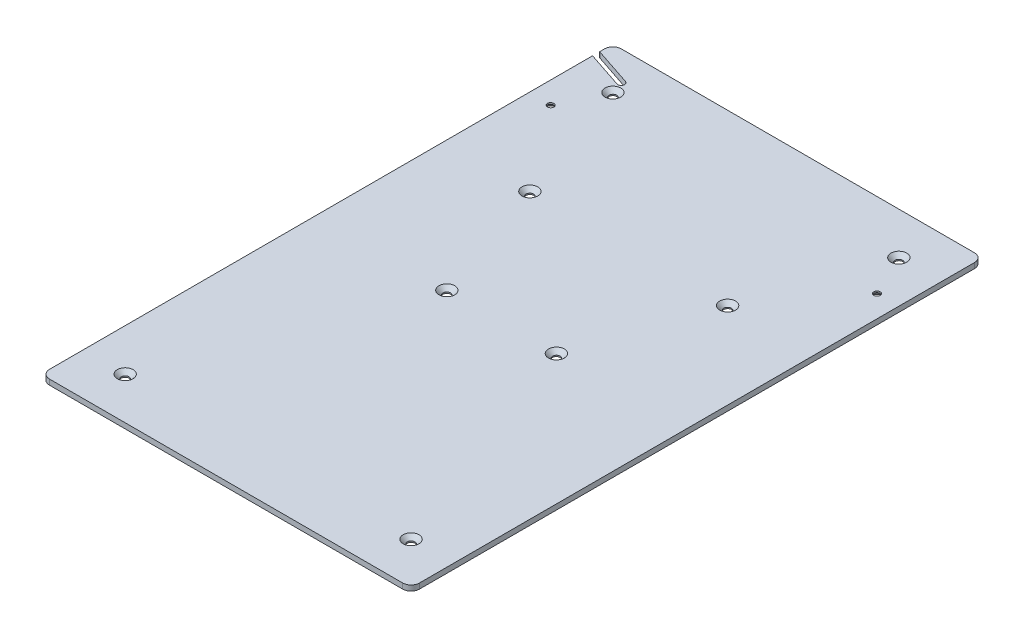
ISO-10303-21;
HEADER;
FILE_DESCRIPTION(('STEP AP214'),'2;1');
FILE_NAME('part.step','',(''),(''),'','','');
FILE_SCHEMA(('AUTOMOTIVE_DESIGN { 1 0 10303 214 1 1 1 1 }'));
ENDSEC;
DATA;
#1=APPLICATION_CONTEXT('core data for automotive mechanical design processes');
#2=APPLICATION_PROTOCOL_DEFINITION('international standard','automotive_design',2000,#1);
#3=PRODUCT_CONTEXT('',#1,'mechanical');
#4=PRODUCT('Part','Part','',(#3));
#5=PRODUCT_RELATED_PRODUCT_CATEGORY('part','',(#4));
#6=PRODUCT_DEFINITION_FORMATION('','',#4);
#7=PRODUCT_DEFINITION_CONTEXT('part definition',#1,'design');
#8=PRODUCT_DEFINITION('design','',#6,#7);
#9=PRODUCT_DEFINITION_SHAPE('','',#8);
#10=(LENGTH_UNIT() NAMED_UNIT(*) SI_UNIT(.MILLI.,.METRE.));
#11=(NAMED_UNIT(*) PLANE_ANGLE_UNIT() SI_UNIT($,.RADIAN.));
#12=(NAMED_UNIT(*) SI_UNIT($,.STERADIAN.) SOLID_ANGLE_UNIT());
#13=UNCERTAINTY_MEASURE_WITH_UNIT(LENGTH_MEASURE(1.E-05),#10,'distance_accuracy_value','');
#14=(GEOMETRIC_REPRESENTATION_CONTEXT(3) GLOBAL_UNCERTAINTY_ASSIGNED_CONTEXT((#13)) GLOBAL_UNIT_ASSIGNED_CONTEXT((#10,
#11,#12)) REPRESENTATION_CONTEXT('',''));
#15=CARTESIAN_POINT('',(0.,0.,0.));
#16=DIRECTION('',(0.,0.,1.));
#17=DIRECTION('',(1.,0.,0.));
#18=AXIS2_PLACEMENT_3D('',#15,#16,#17);
#19=CARTESIAN_POINT('',(-110.,3.175,-170.));
#20=DIRECTION('',(1.,0.,0.));
#21=DIRECTION('',(0.,0.,-1.));
#22=AXIS2_PLACEMENT_3D('',#19,#20,#21);
#23=PLANE('',#22);
#24=DIRECTION('',(0.,0.,1.));
#25=VECTOR('',#24,1.);
#26=CARTESIAN_POINT('',(-110.,0.,-170.));
#27=LINE('',#26,#25);
#28=CARTESIAN_POINT('',(-110.,0.,-165.));
#29=VERTEX_POINT('',#28);
#30=CARTESIAN_POINT('',(-110.,0.,-162.));
#31=VERTEX_POINT('',#30);
#32=EDGE_CURVE('E278',#29,#31,#27,.T.);
#33=ORIENTED_EDGE('',*,*,#32,.T.);
#34=DIRECTION('',(0.,1.,0.));
#35=VECTOR('',#34,1.);
#36=CARTESIAN_POINT('',(-110.,0.,-162.));
#37=LINE('',#36,#35);
#38=CARTESIAN_POINT('',(-110.,3.175,-162.));
#39=VERTEX_POINT('',#38);
#40=EDGE_CURVE('E171',#31,#39,#37,.T.);
#41=ORIENTED_EDGE('',*,*,#40,.T.);
#42=DIRECTION('',(0.,0.,1.));
#43=VECTOR('',#42,1.);
#44=CARTESIAN_POINT('',(-110.,3.175,-170.));
#45=LINE('',#44,#43);
#46=CARTESIAN_POINT('',(-110.,3.175,-165.));
#47=VERTEX_POINT('',#46);
#48=EDGE_CURVE('E265',#47,#39,#45,.T.);
#49=ORIENTED_EDGE('',*,*,#48,.F.);
#50=DIRECTION('',(0.,-1.,0.));
#51=VECTOR('',#50,1.);
#52=CARTESIAN_POINT('',(-110.,3.175,-165.));
#53=LINE('',#52,#51);
#54=EDGE_CURVE('E318',#47,#29,#53,.T.);
#55=ORIENTED_EDGE('',*,*,#54,.T.);
#56=EDGE_LOOP('',(#33,#41,#49,#55));
#57=FACE_BOUND('',#56,.T.);
#58=ADVANCED_FACE('F39',(#57),#23,.F.);
#59=CARTESIAN_POINT('',(-110.,3.175,-157.892304050488));
#60=VERTEX_POINT('',#59);
#61=CARTESIAN_POINT('',(-110.,3.175,165.));
#62=VERTEX_POINT('',#61);
#63=EDGE_CURVE('E269',#60,#62,#45,.T.);
#64=ORIENTED_EDGE('',*,*,#63,.F.);
#65=DIRECTION('',(0.,-1.,0.));
#66=VECTOR('',#65,1.);
#67=CARTESIAN_POINT('',(-110.,3.175,-157.892304050488));
#68=LINE('',#67,#66);
#69=CARTESIAN_POINT('',(-110.,0.,-157.892304050488));
#70=VERTEX_POINT('',#69);
#71=EDGE_CURVE('E166',#60,#70,#68,.T.);
#72=ORIENTED_EDGE('',*,*,#71,.T.);
#73=CARTESIAN_POINT('',(-110.,0.,165.));
#74=VERTEX_POINT('',#73);
#75=EDGE_CURVE('E264',#70,#74,#27,.T.);
#76=ORIENTED_EDGE('',*,*,#75,.T.);
#77=DIRECTION('',(0.,-1.,0.));
#78=VECTOR('',#77,1.);
#79=CARTESIAN_POINT('',(-110.,3.175,165.));
#80=LINE('',#79,#78);
#81=EDGE_CURVE('E315',#74,#62,#80,.F.);
#82=ORIENTED_EDGE('',*,*,#81,.T.);
#83=EDGE_LOOP('',(#64,#72,#76,#82));
#84=FACE_BOUND('',#83,.T.);
#85=ADVANCED_FACE('F373',(#84),#23,.F.);
#86=CARTESIAN_POINT('',(-110.,3.175,170.));
#87=DIRECTION('',(0.,0.,-1.));
#88=DIRECTION('',(-1.,0.,0.));
#89=AXIS2_PLACEMENT_3D('',#86,#87,#88);
#90=PLANE('',#89);
#91=DIRECTION('',(1.,0.,0.));
#92=VECTOR('',#91,1.);
#93=CARTESIAN_POINT('',(-110.,3.175,170.));
#94=LINE('',#93,#92);
#95=CARTESIAN_POINT('',(-105.,3.175,170.));
#96=VERTEX_POINT('',#95);
#97=CARTESIAN_POINT('',(105.,3.175,170.));
#98=VERTEX_POINT('',#97);
#99=EDGE_CURVE('E268',#96,#98,#94,.T.);
#100=ORIENTED_EDGE('',*,*,#99,.F.);
#101=DIRECTION('',(0.,-1.,0.));
#102=VECTOR('',#101,1.);
#103=CARTESIAN_POINT('',(-105.,3.175,170.));
#104=LINE('',#103,#102);
#105=CARTESIAN_POINT('',(-105.,0.,170.));
#106=VERTEX_POINT('',#105);
#107=EDGE_CURVE('E47',#96,#106,#104,.T.);
#108=ORIENTED_EDGE('',*,*,#107,.T.);
#109=DIRECTION('',(1.,0.,0.));
#110=VECTOR('',#109,1.);
#111=CARTESIAN_POINT('',(-110.,0.,170.));
#112=LINE('',#111,#110);
#113=CARTESIAN_POINT('',(105.,0.,170.));
#114=VERTEX_POINT('',#113);
#115=EDGE_CURVE('E281',#106,#114,#112,.T.);
#116=ORIENTED_EDGE('',*,*,#115,.T.);
#117=DIRECTION('',(0.,-1.,0.));
#118=VECTOR('',#117,1.);
#119=CARTESIAN_POINT('',(105.,3.175,170.));
#120=LINE('',#119,#118);
#121=EDGE_CURVE('E62',#114,#98,#120,.F.);
#122=ORIENTED_EDGE('',*,*,#121,.T.);
#123=EDGE_LOOP('',(#100,#108,#116,#122));
#124=FACE_BOUND('',#123,.T.);
#125=ADVANCED_FACE('F324',(#124),#90,.F.);
#126=CARTESIAN_POINT('',(110.,3.175,-170.));
#127=DIRECTION('',(-1.,0.,0.));
#128=DIRECTION('',(0.,0.,1.));
#129=AXIS2_PLACEMENT_3D('',#126,#127,#128);
#130=PLANE('',#129);
#131=DIRECTION('',(0.,0.,-1.));
#132=VECTOR('',#131,1.);
#133=CARTESIAN_POINT('',(110.,0.,-170.));
#134=LINE('',#133,#132);
#135=CARTESIAN_POINT('',(110.,0.,165.));
#136=VERTEX_POINT('',#135);
#137=CARTESIAN_POINT('',(110.,0.,-165.));
#138=VERTEX_POINT('',#137);
#139=EDGE_CURVE('E283',#136,#138,#134,.T.);
#140=ORIENTED_EDGE('',*,*,#139,.T.);
#141=DIRECTION('',(0.,-1.,0.));
#142=VECTOR('',#141,1.);
#143=CARTESIAN_POINT('',(110.,3.175,-165.));
#144=LINE('',#143,#142);
#145=CARTESIAN_POINT('',(110.,3.175,-165.));
#146=VERTEX_POINT('',#145);
#147=EDGE_CURVE('E305',#138,#146,#144,.F.);
#148=ORIENTED_EDGE('',*,*,#147,.T.);
#149=DIRECTION('',(0.,0.,-1.));
#150=VECTOR('',#149,1.);
#151=CARTESIAN_POINT('',(110.,3.175,-170.));
#152=LINE('',#151,#150);
#153=CARTESIAN_POINT('',(110.,3.175,165.));
#154=VERTEX_POINT('',#153);
#155=EDGE_CURVE('E271',#154,#146,#152,.T.);
#156=ORIENTED_EDGE('',*,*,#155,.F.);
#157=DIRECTION('',(0.,-1.,0.));
#158=VECTOR('',#157,1.);
#159=CARTESIAN_POINT('',(110.,3.175,165.));
#160=LINE('',#159,#158);
#161=EDGE_CURVE('E302',#154,#136,#160,.T.);
#162=ORIENTED_EDGE('',*,*,#161,.T.);
#163=EDGE_LOOP('',(#140,#148,#156,#162));
#164=FACE_BOUND('',#163,.T.);
#165=ADVANCED_FACE('F334',(#164),#130,.F.);
#166=CARTESIAN_POINT('',(-110.,3.175,-170.));
#167=DIRECTION('',(0.,0.,1.));
#168=DIRECTION('',(1.,0.,0.));
#169=AXIS2_PLACEMENT_3D('',#166,#167,#168);
#170=PLANE('',#169);
#171=DIRECTION('',(-1.,0.,0.));
#172=VECTOR('',#171,1.);
#173=CARTESIAN_POINT('',(-110.,3.175,-170.));
#174=LINE('',#173,#172);
#175=CARTESIAN_POINT('',(105.,3.175,-170.));
#176=VERTEX_POINT('',#175);
#177=CARTESIAN_POINT('',(-105.,3.175,-170.));
#178=VERTEX_POINT('',#177);
#179=EDGE_CURVE('E274',#176,#178,#174,.T.);
#180=ORIENTED_EDGE('',*,*,#179,.F.);
#181=DIRECTION('',(0.,-1.,0.));
#182=VECTOR('',#181,1.);
#183=CARTESIAN_POINT('',(105.,3.175,-170.));
#184=LINE('',#183,#182);
#185=CARTESIAN_POINT('',(105.,0.,-170.));
#186=VERTEX_POINT('',#185);
#187=EDGE_CURVE('E290',#176,#186,#184,.T.);
#188=ORIENTED_EDGE('',*,*,#187,.T.);
#189=DIRECTION('',(-1.,0.,0.));
#190=VECTOR('',#189,1.);
#191=CARTESIAN_POINT('',(-110.,0.,-170.));
#192=LINE('',#191,#190);
#193=CARTESIAN_POINT('',(-105.,0.,-170.));
#194=VERTEX_POINT('',#193);
#195=EDGE_CURVE('E286',#186,#194,#192,.T.);
#196=ORIENTED_EDGE('',*,*,#195,.T.);
#197=DIRECTION('',(0.,-1.,0.));
#198=VECTOR('',#197,1.);
#199=CARTESIAN_POINT('',(-105.,3.175,-170.));
#200=LINE('',#199,#198);
#201=EDGE_CURVE('E277',#194,#178,#200,.F.);
#202=ORIENTED_EDGE('',*,*,#201,.T.);
#203=EDGE_LOOP('',(#180,#188,#196,#202));
#204=FACE_BOUND('',#203,.T.);
#205=ADVANCED_FACE('F347',(#204),#170,.F.);
#206=CARTESIAN_POINT('',(-110.,3.175,170.));
#207=DIRECTION('',(0.,1.,0.));
#208=DIRECTION('',(0.,0.,1.));
#209=AXIS2_PLACEMENT_3D('',#206,#207,#208);
#210=PLANE('',#209);
#211=CARTESIAN_POINT('',(-110.,3.175,-160.));
#212=DIRECTION('',(0.,1.,0.));
#213=DIRECTION('',(0.,0.,1.));
#214=AXIS2_PLACEMENT_3D('',#211,#212,#213);
#215=CIRCLE('',#214,1.99999999999997);
#216=CARTESIAN_POINT('',(-109.368867035246,3.175,-161.897806939813));
#217=VERTEX_POINT('',#216);
#218=EDGE_CURVE('E160',#217,#39,#215,.T.);
#219=ORIENTED_EDGE('',*,*,#218,.F.);
#220=DIRECTION('',(-0.948903469906339,0.,-0.315566482376866));
#221=VECTOR('',#220,1.);
#222=CARTESIAN_POINT('',(-109.368867035246,3.175,-161.897806939813));
#223=LINE('',#222,#221);
#224=CARTESIAN_POINT('',(-86.9910486519973,3.175,-154.455859835154));
#225=VERTEX_POINT('',#224);
#226=EDGE_CURVE('E157',#225,#217,#223,.T.);
#227=ORIENTED_EDGE('',*,*,#226,.F.);
#228=CARTESIAN_POINT('',(-87.622181616751,3.175,-152.558052895341));
#229=DIRECTION('',(0.,1.,0.));
#230=DIRECTION('',(0.,0.,1.));
#231=AXIS2_PLACEMENT_3D('',#228,#229,#230);
#232=CIRCLE('',#231,2.00000000000001);
#233=CARTESIAN_POINT('',(-88.2533145815047,3.175,-150.660245955528));
#234=VERTEX_POINT('',#233);
#235=EDGE_CURVE('E139',#234,#225,#232,.T.);
#236=ORIENTED_EDGE('',*,*,#235,.F.);
#237=DIRECTION('',(0.948903469906338,0.,0.31556648237687));
#238=VECTOR('',#237,1.);
#239=CARTESIAN_POINT('',(-110.631132964754,3.175,-158.102193060187));
#240=LINE('',#239,#238);
#241=EDGE_CURVE('E162',#60,#234,#240,.T.);
#242=ORIENTED_EDGE('',*,*,#241,.F.);
#243=ORIENTED_EDGE('',*,*,#63,.T.);
#244=CARTESIAN_POINT('',(-105.,3.175,165.));
#245=DIRECTION('',(0.,1.,0.));
#246=DIRECTION('',(0.,0.,1.));
#247=AXIS2_PLACEMENT_3D('',#244,#245,#246);
#248=CIRCLE('',#247,5.);
#249=EDGE_CURVE('E309',#62,#96,#248,.T.);
#250=ORIENTED_EDGE('',*,*,#249,.T.);
#251=ORIENTED_EDGE('',*,*,#99,.T.);
#252=CARTESIAN_POINT('',(105.,3.175,165.));
#253=DIRECTION('',(0.,1.,0.));
#254=DIRECTION('',(0.,0.,1.));
#255=AXIS2_PLACEMENT_3D('',#252,#253,#254);
#256=CIRCLE('',#255,5.);
#257=EDGE_CURVE('E307',#98,#154,#256,.T.);
#258=ORIENTED_EDGE('',*,*,#257,.T.);
#259=ORIENTED_EDGE('',*,*,#155,.T.);
#260=CARTESIAN_POINT('',(105.,3.175,-165.));
#261=DIRECTION('',(0.,1.,0.));
#262=DIRECTION('',(0.,0.,1.));
#263=AXIS2_PLACEMENT_3D('',#260,#261,#262);
#264=CIRCLE('',#263,5.);
#265=EDGE_CURVE('E313',#146,#176,#264,.T.);
#266=ORIENTED_EDGE('',*,*,#265,.T.);
#267=ORIENTED_EDGE('',*,*,#179,.T.);
#268=CARTESIAN_POINT('',(-105.,3.175,-165.));
#269=DIRECTION('',(0.,1.,0.));
#270=DIRECTION('',(0.,0.,1.));
#271=AXIS2_PLACEMENT_3D('',#268,#269,#270);
#272=CIRCLE('',#271,5.);
#273=EDGE_CURVE('E311',#178,#47,#272,.T.);
#274=ORIENTED_EDGE('',*,*,#273,.T.);
#275=ORIENTED_EDGE('',*,*,#48,.T.);
#276=EDGE_LOOP('',(#219,#227,#236,#242,#243,#250,#251,#258,#259,#266,#267,#274,#275));
#277=FACE_BOUND('',#276,.T.);
#278=CARTESIAN_POINT('',(85.,3.175,145.));
#279=DIRECTION('',(0.,1.,0.));
#280=DIRECTION('',(0.,0.,1.));
#281=AXIS2_PLACEMENT_3D('',#278,#279,#280);
#282=CIRCLE('',#281,4.7);
#283=CARTESIAN_POINT('',(85.,3.175,149.7));
#284=VERTEX_POINT('',#283);
#285=EDGE_CURVE('E174',#284,#284,#282,.T.);
#286=ORIENTED_EDGE('',*,*,#285,.F.);
#287=EDGE_LOOP('',(#286));
#288=FACE_BOUND('',#287,.T.);
#289=CARTESIAN_POINT('',(32.5563676649805,3.175,6.16105790682097));
#290=DIRECTION('',(0.,1.,0.));
#291=DIRECTION('',(0.,0.,1.));
#292=AXIS2_PLACEMENT_3D('',#289,#290,#291);
#293=CIRCLE('',#292,4.7);
#294=CARTESIAN_POINT('',(32.5563676649805,3.175,10.861057906821));
#295=VERTEX_POINT('',#294);
#296=EDGE_CURVE('E183',#295,#295,#293,.T.);
#297=ORIENTED_EDGE('',*,*,#296,.F.);
#298=EDGE_LOOP('',(#297));
#299=FACE_BOUND('',#298,.T.);
#300=CARTESIAN_POINT('',(58.7781838324903,3.175,-69.4194710465895));
#301=DIRECTION('',(0.,1.,0.));
#302=DIRECTION('',(0.,0.,1.));
#303=AXIS2_PLACEMENT_3D('',#300,#301,#302);
#304=CIRCLE('',#303,4.7);
#305=CARTESIAN_POINT('',(58.7781838324903,3.175,-64.7194710465895));
#306=VERTEX_POINT('',#305);
#307=EDGE_CURVE('E192',#306,#306,#304,.T.);
#308=ORIENTED_EDGE('',*,*,#307,.F.);
#309=EDGE_LOOP('',(#308));
#310=FACE_BOUND('',#309,.T.);
#311=CARTESIAN_POINT('',(85.,3.175,-145.));
#312=DIRECTION('',(0.,1.,0.));
#313=DIRECTION('',(0.,0.,1.));
#314=AXIS2_PLACEMENT_3D('',#311,#312,#313);
#315=CIRCLE('',#314,4.7);
#316=CARTESIAN_POINT('',(85.,3.175,-140.3));
#317=VERTEX_POINT('',#316);
#318=EDGE_CURVE('E201',#317,#317,#315,.T.);
#319=ORIENTED_EDGE('',*,*,#318,.F.);
#320=EDGE_LOOP('',(#319));
#321=FACE_BOUND('',#320,.T.);
#322=CARTESIAN_POINT('',(-85.,3.175,145.));
#323=DIRECTION('',(0.,1.,0.));
#324=DIRECTION('',(0.,0.,1.));
#325=AXIS2_PLACEMENT_3D('',#322,#323,#324);
#326=CIRCLE('',#325,4.7);
#327=CARTESIAN_POINT('',(-85.,3.175,149.7));
#328=VERTEX_POINT('',#327);
#329=EDGE_CURVE('E210',#328,#328,#326,.T.);
#330=ORIENTED_EDGE('',*,*,#329,.F.);
#331=EDGE_LOOP('',(#330));
#332=FACE_BOUND('',#331,.T.);
#333=CARTESIAN_POINT('',(-32.5563676649805,3.175,6.16105790682097));
#334=DIRECTION('',(0.,1.,0.));
#335=DIRECTION('',(0.,0.,1.));
#336=AXIS2_PLACEMENT_3D('',#333,#334,#335);
#337=CIRCLE('',#336,4.7);
#338=CARTESIAN_POINT('',(-32.5563676649805,3.175,10.861057906821));
#339=VERTEX_POINT('',#338);
#340=EDGE_CURVE('E219',#339,#339,#337,.T.);
#341=ORIENTED_EDGE('',*,*,#340,.F.);
#342=EDGE_LOOP('',(#341));
#343=FACE_BOUND('',#342,.T.);
#344=CARTESIAN_POINT('',(-58.7781838324903,3.175,-69.4194710465895));
#345=DIRECTION('',(0.,1.,0.));
#346=DIRECTION('',(0.,0.,1.));
#347=AXIS2_PLACEMENT_3D('',#344,#345,#346);
#348=CIRCLE('',#347,4.7);
#349=CARTESIAN_POINT('',(-58.7781838324903,3.175,-64.7194710465895));
#350=VERTEX_POINT('',#349);
#351=EDGE_CURVE('E228',#350,#350,#348,.T.);
#352=ORIENTED_EDGE('',*,*,#351,.F.);
#353=EDGE_LOOP('',(#352));
#354=FACE_BOUND('',#353,.T.);
#355=CARTESIAN_POINT('',(-85.,3.175,-145.));
#356=DIRECTION('',(0.,1.,0.));
#357=DIRECTION('',(0.,0.,1.));
#358=AXIS2_PLACEMENT_3D('',#355,#356,#357);
#359=CIRCLE('',#358,4.7);
#360=CARTESIAN_POINT('',(-85.,3.175,-140.3));
#361=VERTEX_POINT('',#360);
#362=EDGE_CURVE('E237',#361,#361,#359,.T.);
#363=ORIENTED_EDGE('',*,*,#362,.F.);
#364=EDGE_LOOP('',(#363));
#365=FACE_BOUND('',#364,.T.);
#366=CARTESIAN_POINT('',(97.,3.175,-120.));
#367=DIRECTION('',(0.,-1.,0.));
#368=DIRECTION('',(0.,0.,-1.));
#369=AXIS2_PLACEMENT_3D('',#366,#367,#368);
#370=CIRCLE('',#369,1.89865);
#371=CARTESIAN_POINT('',(97.,3.175,-121.89865));
#372=VERTEX_POINT('',#371);
#373=EDGE_CURVE('E252',#372,#372,#370,.T.);
#374=ORIENTED_EDGE('',*,*,#373,.T.);
#375=EDGE_LOOP('',(#374));
#376=FACE_BOUND('',#375,.T.);
#377=CARTESIAN_POINT('',(-97.,3.175,-120.));
#378=DIRECTION('',(0.,-1.,0.));
#379=DIRECTION('',(0.,0.,-1.));
#380=AXIS2_PLACEMENT_3D('',#377,#378,#379);
#381=CIRCLE('',#380,1.89865);
#382=CARTESIAN_POINT('',(-97.,3.175,-121.89865));
#383=VERTEX_POINT('',#382);
#384=EDGE_CURVE('E261',#383,#383,#381,.T.);
#385=ORIENTED_EDGE('',*,*,#384,.T.);
#386=EDGE_LOOP('',(#385));
#387=FACE_BOUND('',#386,.T.);
#388=ADVANCED_FACE('F339',(#277,#288,#299,#310,#321,#332,#343,#354,#365,#376,#387),#210,.T.);
#389=CARTESIAN_POINT('',(-110.,0.,170.));
#390=DIRECTION('',(0.,1.,0.));
#391=DIRECTION('',(0.,0.,1.));
#392=AXIS2_PLACEMENT_3D('',#389,#390,#391);
#393=PLANE('',#392);
#394=CARTESIAN_POINT('',(85.,1.83447007584547E-13,145.));
#395=DIRECTION('',(0.,1.,0.));
#396=DIRECTION('',(0.,0.,1.));
#397=AXIS2_PLACEMENT_3D('',#394,#395,#396);
#398=CIRCLE('',#397,2.25);
#399=CARTESIAN_POINT('',(85.,1.83447007584547E-13,147.25));
#400=VERTEX_POINT('',#399);
#401=EDGE_CURVE('E180',#400,#400,#398,.T.);
#402=ORIENTED_EDGE('',*,*,#401,.T.);
#403=EDGE_LOOP('',(#402));
#404=FACE_BOUND('',#403,.T.);
#405=CARTESIAN_POINT('',(32.5563676649805,1.83447007584547E-13,6.16105790682097));
#406=DIRECTION('',(0.,1.,0.));
#407=DIRECTION('',(0.,0.,1.));
#408=AXIS2_PLACEMENT_3D('',#405,#406,#407);
#409=CIRCLE('',#408,2.25);
#410=CARTESIAN_POINT('',(32.5563676649805,1.83447007584547E-13,8.41105790682097));
#411=VERTEX_POINT('',#410);
#412=EDGE_CURVE('E189',#411,#411,#409,.T.);
#413=ORIENTED_EDGE('',*,*,#412,.T.);
#414=EDGE_LOOP('',(#413));
#415=FACE_BOUND('',#414,.T.);
#416=CARTESIAN_POINT('',(58.7781838324903,1.83447007584547E-13,-69.4194710465895));
#417=DIRECTION('',(0.,1.,0.));
#418=DIRECTION('',(0.,0.,1.));
#419=AXIS2_PLACEMENT_3D('',#416,#417,#418);
#420=CIRCLE('',#419,2.25);
#421=CARTESIAN_POINT('',(58.7781838324903,1.83447007584547E-13,-67.1694710465895));
#422=VERTEX_POINT('',#421);
#423=EDGE_CURVE('E198',#422,#422,#420,.T.);
#424=ORIENTED_EDGE('',*,*,#423,.T.);
#425=EDGE_LOOP('',(#424));
#426=FACE_BOUND('',#425,.T.);
#427=CARTESIAN_POINT('',(85.,1.83447007584547E-13,-145.));
#428=DIRECTION('',(0.,1.,0.));
#429=DIRECTION('',(0.,0.,1.));
#430=AXIS2_PLACEMENT_3D('',#427,#428,#429);
#431=CIRCLE('',#430,2.25);
#432=CARTESIAN_POINT('',(85.,1.83447007584547E-13,-142.75));
#433=VERTEX_POINT('',#432);
#434=EDGE_CURVE('E207',#433,#433,#431,.T.);
#435=ORIENTED_EDGE('',*,*,#434,.T.);
#436=EDGE_LOOP('',(#435));
#437=FACE_BOUND('',#436,.T.);
#438=CARTESIAN_POINT('',(-85.,1.83447007584547E-13,145.));
#439=DIRECTION('',(0.,1.,0.));
#440=DIRECTION('',(0.,0.,1.));
#441=AXIS2_PLACEMENT_3D('',#438,#439,#440);
#442=CIRCLE('',#441,2.25);
#443=CARTESIAN_POINT('',(-85.,1.83447007584547E-13,147.25));
#444=VERTEX_POINT('',#443);
#445=EDGE_CURVE('E216',#444,#444,#442,.T.);
#446=ORIENTED_EDGE('',*,*,#445,.T.);
#447=EDGE_LOOP('',(#446));
#448=FACE_BOUND('',#447,.T.);
#449=CARTESIAN_POINT('',(-32.5563676649805,1.83447007584547E-13,6.16105790682097));
#450=DIRECTION('',(0.,1.,0.));
#451=DIRECTION('',(0.,0.,1.));
#452=AXIS2_PLACEMENT_3D('',#449,#450,#451);
#453=CIRCLE('',#452,2.25);
#454=CARTESIAN_POINT('',(-32.5563676649805,1.83447007584547E-13,8.41105790682097));
#455=VERTEX_POINT('',#454);
#456=EDGE_CURVE('E225',#455,#455,#453,.T.);
#457=ORIENTED_EDGE('',*,*,#456,.T.);
#458=EDGE_LOOP('',(#457));
#459=FACE_BOUND('',#458,.T.);
#460=CARTESIAN_POINT('',(-58.7781838324903,1.83447007584547E-13,-69.4194710465895));
#461=DIRECTION('',(0.,1.,0.));
#462=DIRECTION('',(0.,0.,1.));
#463=AXIS2_PLACEMENT_3D('',#460,#461,#462);
#464=CIRCLE('',#463,2.25);
#465=CARTESIAN_POINT('',(-58.7781838324903,1.83447007584547E-13,-67.1694710465895));
#466=VERTEX_POINT('',#465);
#467=EDGE_CURVE('E234',#466,#466,#464,.T.);
#468=ORIENTED_EDGE('',*,*,#467,.T.);
#469=EDGE_LOOP('',(#468));
#470=FACE_BOUND('',#469,.T.);
#471=CARTESIAN_POINT('',(-85.,1.83447007584547E-13,-145.));
#472=DIRECTION('',(0.,1.,0.));
#473=DIRECTION('',(0.,0.,1.));
#474=AXIS2_PLACEMENT_3D('',#471,#472,#473);
#475=CIRCLE('',#474,2.25);
#476=CARTESIAN_POINT('',(-85.,1.83447007584547E-13,-142.75));
#477=VERTEX_POINT('',#476);
#478=EDGE_CURVE('E243',#477,#477,#475,.T.);
#479=ORIENTED_EDGE('',*,*,#478,.T.);
#480=EDGE_LOOP('',(#479));
#481=FACE_BOUND('',#480,.T.);
#482=CARTESIAN_POINT('',(97.,0.,-120.));
#483=DIRECTION('',(0.,-1.,0.));
#484=DIRECTION('',(0.,0.,-1.));
#485=AXIS2_PLACEMENT_3D('',#482,#483,#484);
#486=CIRCLE('',#485,3.8989);
#487=CARTESIAN_POINT('',(97.,0.,-123.8989));
#488=VERTEX_POINT('',#487);
#489=EDGE_CURVE('E246',#488,#488,#486,.T.);
#490=ORIENTED_EDGE('',*,*,#489,.F.);
#491=EDGE_LOOP('',(#490));
#492=FACE_BOUND('',#491,.T.);
#493=CARTESIAN_POINT('',(-97.,0.,-120.));
#494=DIRECTION('',(0.,-1.,0.));
#495=DIRECTION('',(0.,0.,-1.));
#496=AXIS2_PLACEMENT_3D('',#493,#494,#495);
#497=CIRCLE('',#496,3.8989);
#498=CARTESIAN_POINT('',(-97.,0.,-123.8989));
#499=VERTEX_POINT('',#498);
#500=EDGE_CURVE('E255',#499,#499,#497,.T.);
#501=ORIENTED_EDGE('',*,*,#500,.F.);
#502=EDGE_LOOP('',(#501));
#503=FACE_BOUND('',#502,.T.);
#504=DIRECTION('',(-0.948903469906339,0.,-0.315566482376866));
#505=VECTOR('',#504,1.);
#506=CARTESIAN_POINT('',(-109.368867035246,0.,-161.897806939813));
#507=LINE('',#506,#505);
#508=CARTESIAN_POINT('',(-86.9910486519973,0.,-154.455859835154));
#509=VERTEX_POINT('',#508);
#510=CARTESIAN_POINT('',(-109.368867035246,0.,-161.897806939813));
#511=VERTEX_POINT('',#510);
#512=EDGE_CURVE('E147',#509,#511,#507,.T.);
#513=ORIENTED_EDGE('',*,*,#512,.T.);
#514=CARTESIAN_POINT('',(-110.,0.,-160.));
#515=DIRECTION('',(0.,1.,0.));
#516=DIRECTION('',(0.,0.,1.));
#517=AXIS2_PLACEMENT_3D('',#514,#515,#516);
#518=CIRCLE('',#517,1.99999999999997);
#519=EDGE_CURVE('E155',#511,#31,#518,.T.);
#520=ORIENTED_EDGE('',*,*,#519,.T.);
#521=ORIENTED_EDGE('',*,*,#32,.F.);
#522=CARTESIAN_POINT('',(-105.,0.,-165.));
#523=DIRECTION('',(0.,1.,0.));
#524=DIRECTION('',(0.,0.,1.));
#525=AXIS2_PLACEMENT_3D('',#522,#523,#524);
#526=CIRCLE('',#525,5.);
#527=EDGE_CURVE('E298',#29,#194,#526,.F.);
#528=ORIENTED_EDGE('',*,*,#527,.T.);
#529=ORIENTED_EDGE('',*,*,#195,.F.);
#530=CARTESIAN_POINT('',(105.,0.,-165.));
#531=DIRECTION('',(0.,1.,0.));
#532=DIRECTION('',(0.,0.,1.));
#533=AXIS2_PLACEMENT_3D('',#530,#531,#532);
#534=CIRCLE('',#533,5.);
#535=EDGE_CURVE('E300',#186,#138,#534,.F.);
#536=ORIENTED_EDGE('',*,*,#535,.T.);
#537=ORIENTED_EDGE('',*,*,#139,.F.);
#538=CARTESIAN_POINT('',(105.,0.,165.));
#539=DIRECTION('',(0.,1.,0.));
#540=DIRECTION('',(0.,0.,1.));
#541=AXIS2_PLACEMENT_3D('',#538,#539,#540);
#542=CIRCLE('',#541,5.);
#543=EDGE_CURVE('E293',#136,#114,#542,.F.);
#544=ORIENTED_EDGE('',*,*,#543,.T.);
#545=ORIENTED_EDGE('',*,*,#115,.F.);
#546=CARTESIAN_POINT('',(-105.,0.,165.));
#547=DIRECTION('',(0.,1.,0.));
#548=DIRECTION('',(0.,0.,1.));
#549=AXIS2_PLACEMENT_3D('',#546,#547,#548);
#550=CIRCLE('',#549,5.);
#551=EDGE_CURVE('E295',#106,#74,#550,.F.);
#552=ORIENTED_EDGE('',*,*,#551,.T.);
#553=ORIENTED_EDGE('',*,*,#75,.F.);
#554=DIRECTION('',(0.948903469906338,0.,0.31556648237687));
#555=VECTOR('',#554,1.);
#556=CARTESIAN_POINT('',(-11.8152300272825,0.,-125.240065476283));
#557=LINE('',#556,#555);
#558=CARTESIAN_POINT('',(-88.2533145815047,0.,-150.660245955528));
#559=VERTEX_POINT('',#558);
#560=EDGE_CURVE('E11',#70,#559,#557,.T.);
#561=ORIENTED_EDGE('',*,*,#560,.T.);
#562=CARTESIAN_POINT('',(-87.622181616751,0.,-152.558052895341));
#563=DIRECTION('',(0.,1.,0.));
#564=DIRECTION('',(0.,0.,1.));
#565=AXIS2_PLACEMENT_3D('',#562,#563,#564);
#566=CIRCLE('',#565,2.00000000000001);
#567=EDGE_CURVE('E54',#559,#509,#566,.T.);
#568=ORIENTED_EDGE('',*,*,#567,.T.);
#569=EDGE_LOOP('',(#513,#520,#521,#528,#529,#536,#537,#544,#545,#552,#553,#561,#568));
#570=FACE_BOUND('',#569,.T.);
#571=ADVANCED_FACE('F153',(#404,#415,#426,#437,#448,#459,#470,#481,#492,#503,#570),#393,.F.);
#572=CARTESIAN_POINT('',(105.,3.175,-165.));
#573=DIRECTION('',(0.,-1.,0.));
#574=DIRECTION('',(0.,0.,-1.));
#575=AXIS2_PLACEMENT_3D('',#572,#573,#574);
#576=CYLINDRICAL_SURFACE('',#575,5.);
#577=ORIENTED_EDGE('',*,*,#265,.F.);
#578=ORIENTED_EDGE('',*,*,#147,.F.);
#579=ORIENTED_EDGE('',*,*,#535,.F.);
#580=ORIENTED_EDGE('',*,*,#187,.F.);
#581=EDGE_LOOP('',(#577,#578,#579,#580));
#582=FACE_BOUND('',#581,.T.);
#583=ADVANCED_FACE('F344',(#582),#576,.T.);
#584=CARTESIAN_POINT('',(-105.,3.175,-165.));
#585=DIRECTION('',(0.,-1.,0.));
#586=DIRECTION('',(0.,0.,-1.));
#587=AXIS2_PLACEMENT_3D('',#584,#585,#586);
#588=CYLINDRICAL_SURFACE('',#587,5.);
#589=ORIENTED_EDGE('',*,*,#273,.F.);
#590=ORIENTED_EDGE('',*,*,#201,.F.);
#591=ORIENTED_EDGE('',*,*,#527,.F.);
#592=ORIENTED_EDGE('',*,*,#54,.F.);
#593=EDGE_LOOP('',(#589,#590,#591,#592));
#594=FACE_BOUND('',#593,.T.);
#595=ADVANCED_FACE('F353',(#594),#588,.T.);
#596=CARTESIAN_POINT('',(-105.,3.175,165.));
#597=DIRECTION('',(0.,-1.,0.));
#598=DIRECTION('',(0.,0.,-1.));
#599=AXIS2_PLACEMENT_3D('',#596,#597,#598);
#600=CYLINDRICAL_SURFACE('',#599,5.);
#601=ORIENTED_EDGE('',*,*,#249,.F.);
#602=ORIENTED_EDGE('',*,*,#81,.F.);
#603=ORIENTED_EDGE('',*,*,#551,.F.);
#604=ORIENTED_EDGE('',*,*,#107,.F.);
#605=EDGE_LOOP('',(#601,#602,#603,#604));
#606=FACE_BOUND('',#605,.T.);
#607=ADVANCED_FACE('F386',(#606),#600,.T.);
#608=CARTESIAN_POINT('',(105.,3.175,165.));
#609=DIRECTION('',(0.,-1.,0.));
#610=DIRECTION('',(0.,0.,-1.));
#611=AXIS2_PLACEMENT_3D('',#608,#609,#610);
#612=CYLINDRICAL_SURFACE('',#611,5.);
#613=ORIENTED_EDGE('',*,*,#257,.F.);
#614=ORIENTED_EDGE('',*,*,#121,.F.);
#615=ORIENTED_EDGE('',*,*,#543,.F.);
#616=ORIENTED_EDGE('',*,*,#161,.F.);
#617=EDGE_LOOP('',(#613,#614,#615,#616));
#618=FACE_BOUND('',#617,.T.);
#619=ADVANCED_FACE('F41',(#618),#612,.T.);
#620=CARTESIAN_POINT('',(-97.,0.,-120.));
#621=DIRECTION('',(0.,-1.,0.));
#622=DIRECTION('',(0.,0.,-1.));
#623=AXIS2_PLACEMENT_3D('',#620,#621,#622);
#624=CYLINDRICAL_SURFACE('',#623,1.89865);
#625=ORIENTED_EDGE('',*,*,#384,.F.);
#626=EDGE_LOOP('',(#625));
#627=FACE_BOUND('',#626,.T.);
#628=CARTESIAN_POINT('',(-97.,2.30102440654382,-120.));
#629=DIRECTION('',(0.,-1.,0.));
#630=DIRECTION('',(0.,0.,-1.));
#631=AXIS2_PLACEMENT_3D('',#628,#629,#630);
#632=CIRCLE('',#631,1.89865);
#633=CARTESIAN_POINT('',(-97.,2.30102440654382,-121.89865));
#634=VERTEX_POINT('',#633);
#635=EDGE_CURVE('E258',#634,#634,#632,.T.);
#636=ORIENTED_EDGE('',*,*,#635,.T.);
#637=EDGE_LOOP('',(#636));
#638=FACE_BOUND('',#637,.T.);
#639=ADVANCED_FACE('F391',(#627,#638),#624,.F.);
#640=CARTESIAN_POINT('',(-97.,0.,-120.));
#641=DIRECTION('',(0.,-1.,0.));
#642=DIRECTION('',(0.,0.,-1.));
#643=AXIS2_PLACEMENT_3D('',#640,#641,#642);
#644=CONICAL_SURFACE('',#643,3.8989,0.715584993317675);
#645=ORIENTED_EDGE('',*,*,#635,.F.);
#646=EDGE_LOOP('',(#645));
#647=FACE_BOUND('',#646,.T.);
#648=ORIENTED_EDGE('',*,*,#500,.T.);
#649=EDGE_LOOP('',(#648));
#650=FACE_BOUND('',#649,.T.);
#651=ADVANCED_FACE('F397',(#647,#650),#644,.F.);
#652=CARTESIAN_POINT('',(97.,0.,-120.));
#653=DIRECTION('',(0.,-1.,0.));
#654=DIRECTION('',(0.,0.,-1.));
#655=AXIS2_PLACEMENT_3D('',#652,#653,#654);
#656=CYLINDRICAL_SURFACE('',#655,1.89865);
#657=ORIENTED_EDGE('',*,*,#373,.F.);
#658=EDGE_LOOP('',(#657));
#659=FACE_BOUND('',#658,.T.);
#660=CARTESIAN_POINT('',(97.,2.30102440654382,-120.));
#661=DIRECTION('',(0.,-1.,0.));
#662=DIRECTION('',(0.,0.,-1.));
#663=AXIS2_PLACEMENT_3D('',#660,#661,#662);
#664=CIRCLE('',#663,1.89865);
#665=CARTESIAN_POINT('',(97.,2.30102440654382,-121.89865));
#666=VERTEX_POINT('',#665);
#667=EDGE_CURVE('E249',#666,#666,#664,.T.);
#668=ORIENTED_EDGE('',*,*,#667,.T.);
#669=EDGE_LOOP('',(#668));
#670=FACE_BOUND('',#669,.T.);
#671=ADVANCED_FACE('F403',(#659,#670),#656,.F.);
#672=CARTESIAN_POINT('',(97.,0.,-120.));
#673=DIRECTION('',(0.,-1.,0.));
#674=DIRECTION('',(0.,0.,-1.));
#675=AXIS2_PLACEMENT_3D('',#672,#673,#674);
#676=CONICAL_SURFACE('',#675,3.8989,0.715584993317675);
#677=ORIENTED_EDGE('',*,*,#667,.F.);
#678=EDGE_LOOP('',(#677));
#679=FACE_BOUND('',#678,.T.);
#680=ORIENTED_EDGE('',*,*,#489,.T.);
#681=EDGE_LOOP('',(#680));
#682=FACE_BOUND('',#681,.T.);
#683=ADVANCED_FACE('F603',(#679,#682),#676,.F.);
#684=CARTESIAN_POINT('',(-85.,3.175,-145.));
#685=DIRECTION('',(0.,1.,0.));
#686=DIRECTION('',(0.,0.,1.));
#687=AXIS2_PLACEMENT_3D('',#684,#685,#686);
#688=CYLINDRICAL_SURFACE('',#687,2.25);
#689=ORIENTED_EDGE('',*,*,#478,.F.);
#690=EDGE_LOOP('',(#689));
#691=FACE_BOUND('',#690,.T.);
#692=CARTESIAN_POINT('',(-85.,0.725,-145.));
#693=DIRECTION('',(0.,1.,0.));
#694=DIRECTION('',(0.,0.,1.));
#695=AXIS2_PLACEMENT_3D('',#692,#693,#694);
#696=CIRCLE('',#695,2.25);
#697=CARTESIAN_POINT('',(-85.,0.725,-142.75));
#698=VERTEX_POINT('',#697);
#699=EDGE_CURVE('E240',#698,#698,#696,.T.);
#700=ORIENTED_EDGE('',*,*,#699,.T.);
#701=EDGE_LOOP('',(#700));
#702=FACE_BOUND('',#701,.T.);
#703=ADVANCED_FACE('F594',(#691,#702),#688,.F.);
#704=CARTESIAN_POINT('',(-85.,3.175,-145.));
#705=DIRECTION('',(0.,1.,0.));
#706=DIRECTION('',(0.,0.,1.));
#707=AXIS2_PLACEMENT_3D('',#704,#705,#706);
#708=CONICAL_SURFACE('',#707,4.7,0.785398163397447);
#709=ORIENTED_EDGE('',*,*,#699,.F.);
#710=EDGE_LOOP('',(#709));
#711=FACE_BOUND('',#710,.T.);
#712=ORIENTED_EDGE('',*,*,#362,.T.);
#713=EDGE_LOOP('',(#712));
#714=FACE_BOUND('',#713,.T.);
#715=ADVANCED_FACE('F585',(#711,#714),#708,.F.);
#716=CARTESIAN_POINT('',(-58.7781838324903,3.175,-69.4194710465895));
#717=DIRECTION('',(0.,1.,0.));
#718=DIRECTION('',(0.,0.,1.));
#719=AXIS2_PLACEMENT_3D('',#716,#717,#718);
#720=CYLINDRICAL_SURFACE('',#719,2.25);
#721=ORIENTED_EDGE('',*,*,#467,.F.);
#722=EDGE_LOOP('',(#721));
#723=FACE_BOUND('',#722,.T.);
#724=CARTESIAN_POINT('',(-58.7781838324903,0.725,-69.4194710465895));
#725=DIRECTION('',(0.,1.,0.));
#726=DIRECTION('',(0.,0.,1.));
#727=AXIS2_PLACEMENT_3D('',#724,#725,#726);
#728=CIRCLE('',#727,2.25);
#729=CARTESIAN_POINT('',(-58.7781838324903,0.725,-67.1694710465895));
#730=VERTEX_POINT('',#729);
#731=EDGE_CURVE('E231',#730,#730,#728,.T.);
#732=ORIENTED_EDGE('',*,*,#731,.T.);
#733=EDGE_LOOP('',(#732));
#734=FACE_BOUND('',#733,.T.);
#735=ADVANCED_FACE('F576',(#723,#734),#720,.F.);
#736=CARTESIAN_POINT('',(-58.7781838324903,3.175,-69.4194710465895));
#737=DIRECTION('',(0.,1.,0.));
#738=DIRECTION('',(0.,0.,1.));
#739=AXIS2_PLACEMENT_3D('',#736,#737,#738);
#740=CONICAL_SURFACE('',#739,4.7,0.785398163397448);
#741=ORIENTED_EDGE('',*,*,#731,.F.);
#742=EDGE_LOOP('',(#741));
#743=FACE_BOUND('',#742,.T.);
#744=ORIENTED_EDGE('',*,*,#351,.T.);
#745=EDGE_LOOP('',(#744));
#746=FACE_BOUND('',#745,.T.);
#747=ADVANCED_FACE('F567',(#743,#746),#740,.F.);
#748=CARTESIAN_POINT('',(-32.5563676649805,3.175,6.16105790682097));
#749=DIRECTION('',(0.,1.,0.));
#750=DIRECTION('',(0.,0.,1.));
#751=AXIS2_PLACEMENT_3D('',#748,#749,#750);
#752=CYLINDRICAL_SURFACE('',#751,2.25);
#753=ORIENTED_EDGE('',*,*,#456,.F.);
#754=EDGE_LOOP('',(#753));
#755=FACE_BOUND('',#754,.T.);
#756=CARTESIAN_POINT('',(-32.5563676649805,0.725,6.16105790682097));
#757=DIRECTION('',(0.,1.,0.));
#758=DIRECTION('',(0.,0.,1.));
#759=AXIS2_PLACEMENT_3D('',#756,#757,#758);
#760=CIRCLE('',#759,2.25);
#761=CARTESIAN_POINT('',(-32.5563676649805,0.725,8.41105790682097));
#762=VERTEX_POINT('',#761);
#763=EDGE_CURVE('E222',#762,#762,#760,.T.);
#764=ORIENTED_EDGE('',*,*,#763,.T.);
#765=EDGE_LOOP('',(#764));
#766=FACE_BOUND('',#765,.T.);
#767=ADVANCED_FACE('F558',(#755,#766),#752,.F.);
#768=CARTESIAN_POINT('',(-32.5563676649805,3.175,6.16105790682097));
#769=DIRECTION('',(0.,1.,0.));
#770=DIRECTION('',(0.,0.,1.));
#771=AXIS2_PLACEMENT_3D('',#768,#769,#770);
#772=CONICAL_SURFACE('',#771,4.7,0.785398163397448);
#773=ORIENTED_EDGE('',*,*,#763,.F.);
#774=EDGE_LOOP('',(#773));
#775=FACE_BOUND('',#774,.T.);
#776=ORIENTED_EDGE('',*,*,#340,.T.);
#777=EDGE_LOOP('',(#776));
#778=FACE_BOUND('',#777,.T.);
#779=ADVANCED_FACE('F549',(#775,#778),#772,.F.);
#780=CARTESIAN_POINT('',(-85.,3.175,145.));
#781=DIRECTION('',(0.,1.,0.));
#782=DIRECTION('',(0.,0.,1.));
#783=AXIS2_PLACEMENT_3D('',#780,#781,#782);
#784=CYLINDRICAL_SURFACE('',#783,2.25);
#785=ORIENTED_EDGE('',*,*,#445,.F.);
#786=EDGE_LOOP('',(#785));
#787=FACE_BOUND('',#786,.T.);
#788=CARTESIAN_POINT('',(-85.,0.725,145.));
#789=DIRECTION('',(0.,1.,0.));
#790=DIRECTION('',(0.,0.,1.));
#791=AXIS2_PLACEMENT_3D('',#788,#789,#790);
#792=CIRCLE('',#791,2.25);
#793=CARTESIAN_POINT('',(-85.,0.725,147.25));
#794=VERTEX_POINT('',#793);
#795=EDGE_CURVE('E213',#794,#794,#792,.T.);
#796=ORIENTED_EDGE('',*,*,#795,.T.);
#797=EDGE_LOOP('',(#796));
#798=FACE_BOUND('',#797,.T.);
#799=ADVANCED_FACE('F540',(#787,#798),#784,.F.);
#800=CARTESIAN_POINT('',(-85.,3.175,145.));
#801=DIRECTION('',(0.,1.,0.));
#802=DIRECTION('',(0.,0.,1.));
#803=AXIS2_PLACEMENT_3D('',#800,#801,#802);
#804=CONICAL_SURFACE('',#803,4.7,0.785398163397447);
#805=ORIENTED_EDGE('',*,*,#795,.F.);
#806=EDGE_LOOP('',(#805));
#807=FACE_BOUND('',#806,.T.);
#808=ORIENTED_EDGE('',*,*,#329,.T.);
#809=EDGE_LOOP('',(#808));
#810=FACE_BOUND('',#809,.T.);
#811=ADVANCED_FACE('F531',(#807,#810),#804,.F.);
#812=CARTESIAN_POINT('',(85.,3.175,-145.));
#813=DIRECTION('',(0.,1.,0.));
#814=DIRECTION('',(0.,0.,1.));
#815=AXIS2_PLACEMENT_3D('',#812,#813,#814);
#816=CYLINDRICAL_SURFACE('',#815,2.25);
#817=ORIENTED_EDGE('',*,*,#434,.F.);
#818=EDGE_LOOP('',(#817));
#819=FACE_BOUND('',#818,.T.);
#820=CARTESIAN_POINT('',(85.,0.725,-145.));
#821=DIRECTION('',(0.,1.,0.));
#822=DIRECTION('',(0.,0.,1.));
#823=AXIS2_PLACEMENT_3D('',#820,#821,#822);
#824=CIRCLE('',#823,2.25);
#825=CARTESIAN_POINT('',(85.,0.725,-142.75));
#826=VERTEX_POINT('',#825);
#827=EDGE_CURVE('E204',#826,#826,#824,.T.);
#828=ORIENTED_EDGE('',*,*,#827,.T.);
#829=EDGE_LOOP('',(#828));
#830=FACE_BOUND('',#829,.T.);
#831=ADVANCED_FACE('F522',(#819,#830),#816,.F.);
#832=CARTESIAN_POINT('',(85.,3.175,-145.));
#833=DIRECTION('',(0.,1.,0.));
#834=DIRECTION('',(0.,0.,1.));
#835=AXIS2_PLACEMENT_3D('',#832,#833,#834);
#836=CONICAL_SURFACE('',#835,4.7,0.785398163397447);
#837=ORIENTED_EDGE('',*,*,#827,.F.);
#838=EDGE_LOOP('',(#837));
#839=FACE_BOUND('',#838,.T.);
#840=ORIENTED_EDGE('',*,*,#318,.T.);
#841=EDGE_LOOP('',(#840));
#842=FACE_BOUND('',#841,.T.);
#843=ADVANCED_FACE('F513',(#839,#842),#836,.F.);
#844=CARTESIAN_POINT('',(58.7781838324903,3.175,-69.4194710465895));
#845=DIRECTION('',(0.,1.,0.));
#846=DIRECTION('',(0.,0.,1.));
#847=AXIS2_PLACEMENT_3D('',#844,#845,#846);
#848=CYLINDRICAL_SURFACE('',#847,2.25);
#849=ORIENTED_EDGE('',*,*,#423,.F.);
#850=EDGE_LOOP('',(#849));
#851=FACE_BOUND('',#850,.T.);
#852=CARTESIAN_POINT('',(58.7781838324903,0.725,-69.4194710465895));
#853=DIRECTION('',(0.,1.,0.));
#854=DIRECTION('',(0.,0.,1.));
#855=AXIS2_PLACEMENT_3D('',#852,#853,#854);
#856=CIRCLE('',#855,2.25);
#857=CARTESIAN_POINT('',(58.7781838324903,0.725,-67.1694710465895));
#858=VERTEX_POINT('',#857);
#859=EDGE_CURVE('E195',#858,#858,#856,.T.);
#860=ORIENTED_EDGE('',*,*,#859,.T.);
#861=EDGE_LOOP('',(#860));
#862=FACE_BOUND('',#861,.T.);
#863=ADVANCED_FACE('F504',(#851,#862),#848,.F.);
#864=CARTESIAN_POINT('',(58.7781838324903,3.175,-69.4194710465895));
#865=DIRECTION('',(0.,1.,0.));
#866=DIRECTION('',(0.,0.,1.));
#867=AXIS2_PLACEMENT_3D('',#864,#865,#866);
#868=CONICAL_SURFACE('',#867,4.7,0.785398163397447);
#869=ORIENTED_EDGE('',*,*,#859,.F.);
#870=EDGE_LOOP('',(#869));
#871=FACE_BOUND('',#870,.T.);
#872=ORIENTED_EDGE('',*,*,#307,.T.);
#873=EDGE_LOOP('',(#872));
#874=FACE_BOUND('',#873,.T.);
#875=ADVANCED_FACE('F495',(#871,#874),#868,.F.);
#876=CARTESIAN_POINT('',(32.5563676649805,3.175,6.16105790682097));
#877=DIRECTION('',(0.,1.,0.));
#878=DIRECTION('',(0.,0.,1.));
#879=AXIS2_PLACEMENT_3D('',#876,#877,#878);
#880=CYLINDRICAL_SURFACE('',#879,2.25);
#881=ORIENTED_EDGE('',*,*,#412,.F.);
#882=EDGE_LOOP('',(#881));
#883=FACE_BOUND('',#882,.T.);
#884=CARTESIAN_POINT('',(32.5563676649805,0.725,6.16105790682097));
#885=DIRECTION('',(0.,1.,0.));
#886=DIRECTION('',(0.,0.,1.));
#887=AXIS2_PLACEMENT_3D('',#884,#885,#886);
#888=CIRCLE('',#887,2.25);
#889=CARTESIAN_POINT('',(32.5563676649805,0.725,8.41105790682097));
#890=VERTEX_POINT('',#889);
#891=EDGE_CURVE('E186',#890,#890,#888,.T.);
#892=ORIENTED_EDGE('',*,*,#891,.T.);
#893=EDGE_LOOP('',(#892));
#894=FACE_BOUND('',#893,.T.);
#895=ADVANCED_FACE('F486',(#883,#894),#880,.F.);
#896=CARTESIAN_POINT('',(32.5563676649805,3.175,6.16105790682097));
#897=DIRECTION('',(0.,1.,0.));
#898=DIRECTION('',(0.,0.,1.));
#899=AXIS2_PLACEMENT_3D('',#896,#897,#898);
#900=CONICAL_SURFACE('',#899,4.7,0.785398163397448);
#901=ORIENTED_EDGE('',*,*,#891,.F.);
#902=EDGE_LOOP('',(#901));
#903=FACE_BOUND('',#902,.T.);
#904=ORIENTED_EDGE('',*,*,#296,.T.);
#905=EDGE_LOOP('',(#904));
#906=FACE_BOUND('',#905,.T.);
#907=ADVANCED_FACE('F477',(#903,#906),#900,.F.);
#908=CARTESIAN_POINT('',(85.,3.175,145.));
#909=DIRECTION('',(0.,1.,0.));
#910=DIRECTION('',(0.,0.,1.));
#911=AXIS2_PLACEMENT_3D('',#908,#909,#910);
#912=CYLINDRICAL_SURFACE('',#911,2.25);
#913=ORIENTED_EDGE('',*,*,#401,.F.);
#914=EDGE_LOOP('',(#913));
#915=FACE_BOUND('',#914,.T.);
#916=CARTESIAN_POINT('',(85.,0.725,145.));
#917=DIRECTION('',(0.,1.,0.));
#918=DIRECTION('',(0.,0.,1.));
#919=AXIS2_PLACEMENT_3D('',#916,#917,#918);
#920=CIRCLE('',#919,2.25);
#921=CARTESIAN_POINT('',(85.,0.725,147.25));
#922=VERTEX_POINT('',#921);
#923=EDGE_CURVE('E177',#922,#922,#920,.T.);
#924=ORIENTED_EDGE('',*,*,#923,.T.);
#925=EDGE_LOOP('',(#924));
#926=FACE_BOUND('',#925,.T.);
#927=ADVANCED_FACE('F369',(#915,#926),#912,.F.);
#928=CARTESIAN_POINT('',(85.,3.175,145.));
#929=DIRECTION('',(0.,1.,0.));
#930=DIRECTION('',(0.,0.,1.));
#931=AXIS2_PLACEMENT_3D('',#928,#929,#930);
#932=CONICAL_SURFACE('',#931,4.7,0.785398163397447);
#933=ORIENTED_EDGE('',*,*,#923,.F.);
#934=EDGE_LOOP('',(#933));
#935=FACE_BOUND('',#934,.T.);
#936=ORIENTED_EDGE('',*,*,#285,.T.);
#937=EDGE_LOOP('',(#936));
#938=FACE_BOUND('',#937,.T.);
#939=ADVANCED_FACE('F360',(#935,#938),#932,.F.);
#940=CARTESIAN_POINT('',(-110.,0.,-160.));
#941=DIRECTION('',(0.,1.,0.));
#942=DIRECTION('',(0.,0.,1.));
#943=AXIS2_PLACEMENT_3D('',#940,#941,#942);
#944=CYLINDRICAL_SURFACE('',#943,1.99999999999997);
#945=ORIENTED_EDGE('',*,*,#519,.F.);
#946=DIRECTION('',(0.,1.,0.));
#947=VECTOR('',#946,1.);
#948=CARTESIAN_POINT('',(-109.368867035246,0.,-161.897806939813));
#949=LINE('',#948,#947);
#950=EDGE_CURVE('E143',#511,#217,#949,.T.);
#951=ORIENTED_EDGE('',*,*,#950,.T.);
#952=ORIENTED_EDGE('',*,*,#218,.T.);
#953=ORIENTED_EDGE('',*,*,#40,.F.);
#954=EDGE_LOOP('',(#945,#951,#952,#953));
#955=FACE_BOUND('',#954,.T.);
#956=ADVANCED_FACE('F357',(#955),#944,.F.);
#957=CARTESIAN_POINT('',(-110.631132964754,0.,-158.102193060187));
#958=DIRECTION('',(-0.31556648237687,0.,0.948903469906338));
#959=DIRECTION('',(0.948903469906338,0.,0.31556648237687));
#960=AXIS2_PLACEMENT_3D('',#957,#958,#959);
#961=PLANE('',#960);
#962=ORIENTED_EDGE('',*,*,#241,.T.);
#963=DIRECTION('',(0.,1.,0.));
#964=VECTOR('',#963,1.);
#965=CARTESIAN_POINT('',(-88.2533145815047,0.,-150.660245955528));
#966=LINE('',#965,#964);
#967=EDGE_CURVE('E144',#559,#234,#966,.T.);
#968=ORIENTED_EDGE('',*,*,#967,.F.);
#969=ORIENTED_EDGE('',*,*,#560,.F.);
#970=ORIENTED_EDGE('',*,*,#71,.F.);
#971=EDGE_LOOP('',(#962,#968,#969,#970));
#972=FACE_BOUND('',#971,.T.);
#973=ADVANCED_FACE('F359',(#972),#961,.F.);
#974=CARTESIAN_POINT('',(-109.368867035246,0.,-161.897806939813));
#975=DIRECTION('',(0.315566482376866,0.,-0.948903469906339));
#976=DIRECTION('',(-0.948903469906339,0.,-0.315566482376866));
#977=AXIS2_PLACEMENT_3D('',#974,#975,#976);
#978=PLANE('',#977);
#979=ORIENTED_EDGE('',*,*,#226,.T.);
#980=ORIENTED_EDGE('',*,*,#950,.F.);
#981=ORIENTED_EDGE('',*,*,#512,.F.);
#982=DIRECTION('',(0.,1.,0.));
#983=VECTOR('',#982,1.);
#984=CARTESIAN_POINT('',(-86.9910486519973,0.,-154.455859835154));
#985=LINE('',#984,#983);
#986=EDGE_CURVE('E135',#509,#225,#985,.T.);
#987=ORIENTED_EDGE('',*,*,#986,.T.);
#988=EDGE_LOOP('',(#979,#980,#981,#987));
#989=FACE_BOUND('',#988,.T.);
#990=ADVANCED_FACE('F148',(#989),#978,.F.);
#991=CARTESIAN_POINT('',(-87.622181616751,0.,-152.558052895341));
#992=DIRECTION('',(0.,1.,0.));
#993=DIRECTION('',(0.,0.,1.));
#994=AXIS2_PLACEMENT_3D('',#991,#992,#993);
#995=CYLINDRICAL_SURFACE('',#994,2.00000000000001);
#996=ORIENTED_EDGE('',*,*,#235,.T.);
#997=ORIENTED_EDGE('',*,*,#986,.F.);
#998=ORIENTED_EDGE('',*,*,#567,.F.);
#999=ORIENTED_EDGE('',*,*,#967,.T.);
#1000=EDGE_LOOP('',(#996,#997,#998,#999));
#1001=FACE_BOUND('',#1000,.T.);
#1002=ADVANCED_FACE('F137',(#1001),#995,.F.);
#1003=CLOSED_SHELL('',(#58,#85,#125,#165,#205,#388,#571,#583,#595,#607,#619,#639,#651,#671,#683,
#703,#715,#735,#747,#767,#779,#799,#811,#831,#843,#863,#875,#895,#907,#927,#939,#956,#973,#990,#1002));
#1004=MANIFOLD_SOLID_BREP('B2',#1003);
#1005=ADVANCED_BREP_SHAPE_REPRESENTATION('',(#18,#1004),#14);
#1006=SHAPE_DEFINITION_REPRESENTATION(#9,#1005);
ENDSEC;
END-ISO-10303-21;
